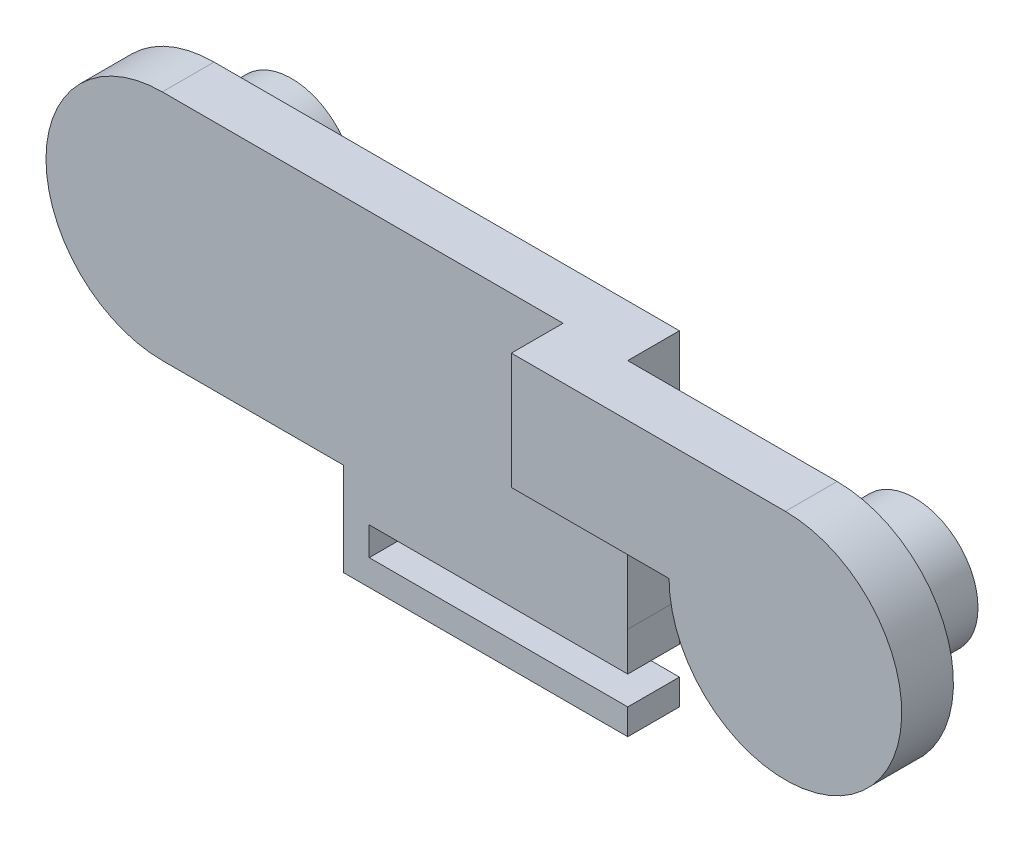
ISO-10303-21;
HEADER;
FILE_DESCRIPTION(('STEP AP214'),'2;1');
FILE_NAME('part.step','',(''),(''),'','','');
FILE_SCHEMA(('AUTOMOTIVE_DESIGN { 1 0 10303 214 1 1 1 1 }'));
ENDSEC;
DATA;
#1=APPLICATION_CONTEXT('core data for automotive mechanical design processes');
#2=APPLICATION_PROTOCOL_DEFINITION('international standard','automotive_design',2000,#1);
#3=PRODUCT_CONTEXT('',#1,'mechanical');
#4=PRODUCT('Part','Part','',(#3));
#5=PRODUCT_RELATED_PRODUCT_CATEGORY('part','',(#4));
#6=PRODUCT_DEFINITION_FORMATION('','',#4);
#7=PRODUCT_DEFINITION_CONTEXT('part definition',#1,'design');
#8=PRODUCT_DEFINITION('design','',#6,#7);
#9=PRODUCT_DEFINITION_SHAPE('','',#8);
#10=(LENGTH_UNIT() NAMED_UNIT(*) SI_UNIT(.MILLI.,.METRE.));
#11=(NAMED_UNIT(*) PLANE_ANGLE_UNIT() SI_UNIT($,.RADIAN.));
#12=(NAMED_UNIT(*) SI_UNIT($,.STERADIAN.) SOLID_ANGLE_UNIT());
#13=UNCERTAINTY_MEASURE_WITH_UNIT(LENGTH_MEASURE(1.E-05),#10,'distance_accuracy_value','');
#14=(GEOMETRIC_REPRESENTATION_CONTEXT(3) GLOBAL_UNCERTAINTY_ASSIGNED_CONTEXT((#13)) GLOBAL_UNIT_ASSIGNED_CONTEXT((#10,
#11,#12)) REPRESENTATION_CONTEXT('',''));
#15=CARTESIAN_POINT('',(0.,0.,0.));
#16=DIRECTION('',(0.,0.,1.));
#17=DIRECTION('',(1.,0.,0.));
#18=AXIS2_PLACEMENT_3D('',#15,#16,#17);
#19=CARTESIAN_POINT('',(0.,0.,-2.));
#20=DIRECTION('',(0.,0.,1.));
#21=DIRECTION('',(1.,0.,0.));
#22=AXIS2_PLACEMENT_3D('',#19,#20,#21);
#23=PLANE('',#22);
#24=DIRECTION('',(0.,-1.,0.));
#25=VECTOR('',#24,1.);
#26=CARTESIAN_POINT('',(-69.4585846447346,-15.9103392702647,-2.));
#27=LINE('',#26,#25);
#28=CARTESIAN_POINT('',(-69.4585846447346,-14.9103392702646,-2.));
#29=VERTEX_POINT('',#28);
#30=CARTESIAN_POINT('',(-69.4585846447346,-15.9103392702647,-2.));
#31=VERTEX_POINT('',#30);
#32=EDGE_CURVE('E11',#29,#31,#27,.T.);
#33=ORIENTED_EDGE('',*,*,#32,.F.);
#34=DIRECTION('',(1.,0.,0.));
#35=VECTOR('',#34,1.);
#36=CARTESIAN_POINT('',(-70.4585846447346,-14.9103392702646,-2.));
#37=LINE('',#36,#35);
#38=CARTESIAN_POINT('',(-60.4585846447346,-14.9103392702646,-2.));
#39=VERTEX_POINT('',#38);
#40=EDGE_CURVE('E197',#29,#39,#37,.T.);
#41=ORIENTED_EDGE('',*,*,#40,.T.);
#42=DIRECTION('',(0.,-1.,0.));
#43=VECTOR('',#42,1.);
#44=CARTESIAN_POINT('',(-60.4585846447346,-15.9103392702647,-2.));
#45=LINE('',#44,#43);
#46=CARTESIAN_POINT('',(-60.4585846447346,-15.9103392702647,-2.));
#47=VERTEX_POINT('',#46);
#48=EDGE_CURVE('E220',#39,#47,#45,.T.);
#49=ORIENTED_EDGE('',*,*,#48,.T.);
#50=DIRECTION('',(-1.,0.,0.));
#51=VECTOR('',#50,1.);
#52=CARTESIAN_POINT('',(-70.4585846447346,-15.9103392702647,-2.));
#53=LINE('',#52,#51);
#54=EDGE_CURVE('E54',#47,#31,#53,.T.);
#55=ORIENTED_EDGE('',*,*,#54,.T.);
#56=EDGE_LOOP('',(#33,#41,#49,#55));
#57=FACE_BOUND('',#56,.T.);
#58=ADVANCED_FACE('F36',(#57),#23,.F.);
#59=CARTESIAN_POINT('',(-78.460741065967,-7.81033927026465,-2.));
#60=DIRECTION('',(0.,0.,1.));
#61=DIRECTION('',(1.,0.,0.));
#62=AXIS2_PLACEMENT_3D('',#59,#60,#61);
#63=CIRCLE('',#62,2.44999999993865);
#64=CARTESIAN_POINT('',(-76.0107410660284,-7.81033927026465,-2.));
#65=VERTEX_POINT('',#64);
#66=EDGE_CURVE('E664',#65,#65,#63,.T.);
#67=ORIENTED_EDGE('',*,*,#66,.T.);
#68=EDGE_LOOP('',(#67));
#69=FACE_BOUND('',#68,.T.);
#70=CARTESIAN_POINT('',(-69.4585846447346,-12.9103392702647,-2.));
#71=VERTEX_POINT('',#70);
#72=CARTESIAN_POINT('',(-69.4585846447346,-13.8103392702646,-2.));
#73=VERTEX_POINT('',#72);
#74=EDGE_CURVE('E46',#71,#73,#27,.T.);
#75=ORIENTED_EDGE('',*,*,#74,.F.);
#76=DIRECTION('',(1.,0.,0.));
#77=VECTOR('',#76,1.);
#78=CARTESIAN_POINT('',(-71.4585846447346,-12.9103392702647,-2.));
#79=LINE('',#78,#77);
#80=CARTESIAN_POINT('',(-71.4585846447346,-12.9103392702647,-2.));
#81=VERTEX_POINT('',#80);
#82=EDGE_CURVE('E667',#81,#71,#79,.T.);
#83=ORIENTED_EDGE('',*,*,#82,.F.);
#84=DIRECTION('',(0.,1.,0.));
#85=VECTOR('',#84,1.);
#86=CARTESIAN_POINT('',(-71.4585846447346,-12.3103392702647,-2.));
#87=LINE('',#86,#85);
#88=CARTESIAN_POINT('',(-71.4585846447346,-12.3103392702647,-2.));
#89=VERTEX_POINT('',#88);
#90=EDGE_CURVE('E193',#81,#89,#87,.T.);
#91=ORIENTED_EDGE('',*,*,#90,.T.);
#92=DIRECTION('',(-1.,0.,0.));
#93=VECTOR('',#92,1.);
#94=CARTESIAN_POINT('',(0.,-12.3103392702647,-2.));
#95=LINE('',#94,#93);
#96=CARTESIAN_POINT('',(-78.460741065967,-12.3103392702647,-2.));
#97=VERTEX_POINT('',#96);
#98=EDGE_CURVE('E249',#89,#97,#95,.T.);
#99=ORIENTED_EDGE('',*,*,#98,.T.);
#100=CARTESIAN_POINT('',(-78.460741065967,-7.81033927026465,-2.));
#101=DIRECTION('',(0.,0.,1.));
#102=DIRECTION('',(1.,0.,0.));
#103=AXIS2_PLACEMENT_3D('',#100,#101,#102);
#104=CIRCLE('',#103,4.5);
#105=CARTESIAN_POINT('',(-78.460741065967,-3.31033927026466,-2.));
#106=VERTEX_POINT('',#105);
#107=EDGE_CURVE('E245',#106,#97,#104,.T.);
#108=ORIENTED_EDGE('',*,*,#107,.F.);
#109=DIRECTION('',(-1.,0.,0.));
#110=VECTOR('',#109,1.);
#111=CARTESIAN_POINT('',(0.,-3.31033927026466,-2.));
#112=LINE('',#111,#110);
#113=CARTESIAN_POINT('',(-60.460741065967,-3.31033927026466,-2.));
#114=VERTEX_POINT('',#113);
#115=EDGE_CURVE('E242',#114,#106,#112,.T.);
#116=ORIENTED_EDGE('',*,*,#115,.F.);
#117=DIRECTION('',(0.,-1.,0.));
#118=VECTOR('',#117,1.);
#119=CARTESIAN_POINT('',(-60.460741065967,0.,-2.));
#120=LINE('',#119,#118);
#121=CARTESIAN_POINT('',(-60.460741065967,-12.3103392702646,-2.));
#122=VERTEX_POINT('',#121);
#123=EDGE_CURVE('E258',#114,#122,#120,.T.);
#124=ORIENTED_EDGE('',*,*,#123,.T.);
#125=DIRECTION('',(-0.00143761266932871,0.999998966634373,0.));
#126=VECTOR('',#125,1.);
#127=CARTESIAN_POINT('',(-60.478313591339,-0.0869444796839806,-2.));
#128=LINE('',#127,#126);
#129=CARTESIAN_POINT('',(-60.4585846447346,-13.8103392702646,-2.));
#130=VERTEX_POINT('',#129);
#131=EDGE_CURVE('E255',#130,#122,#128,.T.);
#132=ORIENTED_EDGE('',*,*,#131,.F.);
#133=DIRECTION('',(-1.,0.,0.));
#134=VECTOR('',#133,1.);
#135=CARTESIAN_POINT('',(0.,-13.8103392702646,-2.));
#136=LINE('',#135,#134);
#137=EDGE_CURVE('E252',#130,#73,#136,.T.);
#138=ORIENTED_EDGE('',*,*,#137,.T.);
#139=EDGE_LOOP('',(#75,#83,#91,#99,#108,#116,#124,#132,#138));
#140=FACE_BOUND('',#139,.T.);
#141=ADVANCED_FACE('F348',(#69,#140),#23,.F.);
#142=CARTESIAN_POINT('',(0.,0.,0.));
#143=DIRECTION('',(0.,0.,1.));
#144=DIRECTION('',(1.,0.,0.));
#145=AXIS2_PLACEMENT_3D('',#142,#143,#144);
#146=PLANE('',#145);
#147=CARTESIAN_POINT('',(-52.360741065967,-7.81033927026465,0.));
#148=DIRECTION('',(0.,0.,1.));
#149=DIRECTION('',(1.,0.,0.));
#150=AXIS2_PLACEMENT_3D('',#147,#148,#149);
#151=CIRCLE('',#150,2.45000000005522);
#152=CARTESIAN_POINT('',(-49.9107410659118,-7.81033927026465,0.));
#153=VERTEX_POINT('',#152);
#154=EDGE_CURVE('E238',#153,#153,#151,.T.);
#155=ORIENTED_EDGE('',*,*,#154,.T.);
#156=EDGE_LOOP('',(#155));
#157=FACE_BOUND('',#156,.T.);
#158=DIRECTION('',(0.,-1.,0.));
#159=VECTOR('',#158,1.);
#160=CARTESIAN_POINT('',(-60.460741065967,0.,0.));
#161=LINE('',#160,#159);
#162=CARTESIAN_POINT('',(-60.460741065967,-3.31033927026466,0.));
#163=VERTEX_POINT('',#162);
#164=CARTESIAN_POINT('',(-60.460741065967,-7.81033927026466,0.));
#165=VERTEX_POINT('',#164);
#166=EDGE_CURVE('E246',#163,#165,#161,.T.);
#167=ORIENTED_EDGE('',*,*,#166,.F.);
#168=DIRECTION('',(-1.,0.,0.));
#169=VECTOR('',#168,1.);
#170=CARTESIAN_POINT('',(0.,-3.31033927026466,0.));
#171=LINE('',#170,#169);
#172=CARTESIAN_POINT('',(-52.360741065967,-3.31033927026466,0.));
#173=VERTEX_POINT('',#172);
#174=EDGE_CURVE('E305',#173,#163,#171,.T.);
#175=ORIENTED_EDGE('',*,*,#174,.F.);
#176=CARTESIAN_POINT('',(-52.360741065967,-7.81033927026465,0.));
#177=DIRECTION('',(0.,0.,1.));
#178=DIRECTION('',(1.,0.,0.));
#179=AXIS2_PLACEMENT_3D('',#176,#177,#178);
#180=CIRCLE('',#179,4.5);
#181=CARTESIAN_POINT('',(-56.860741065967,-7.81033927026466,0.));
#182=VERTEX_POINT('',#181);
#183=EDGE_CURVE('E313',#182,#173,#180,.T.);
#184=ORIENTED_EDGE('',*,*,#183,.F.);
#185=DIRECTION('',(-1.,0.,0.));
#186=VECTOR('',#185,1.);
#187=CARTESIAN_POINT('',(0.,-7.81033927026466,0.));
#188=LINE('',#187,#186);
#189=EDGE_CURVE('E311',#182,#165,#188,.T.);
#190=ORIENTED_EDGE('',*,*,#189,.T.);
#191=EDGE_LOOP('',(#167,#175,#184,#190));
#192=FACE_BOUND('',#191,.T.);
#193=ADVANCED_FACE('F328',(#157,#192),#146,.F.);
#194=CARTESIAN_POINT('',(0.,-7.81033927026466,2.));
#195=DIRECTION('',(0.,-1.,0.));
#196=DIRECTION('',(0.,0.,-1.));
#197=AXIS2_PLACEMENT_3D('',#194,#195,#196);
#198=PLANE('',#197);
#199=ORIENTED_EDGE('',*,*,#189,.F.);
#200=DIRECTION('',(0.,0.,-1.));
#201=VECTOR('',#200,1.);
#202=CARTESIAN_POINT('',(-56.860741065967,-7.81033927026466,2.));
#203=LINE('',#202,#201);
#204=CARTESIAN_POINT('',(-56.860741065967,-7.81033927026466,2.));
#205=VERTEX_POINT('',#204);
#206=EDGE_CURVE('E40',#205,#182,#203,.T.);
#207=ORIENTED_EDGE('',*,*,#206,.F.);
#208=DIRECTION('',(-1.,0.,0.));
#209=VECTOR('',#208,1.);
#210=CARTESIAN_POINT('',(0.,-7.81033927026466,2.));
#211=LINE('',#210,#209);
#212=CARTESIAN_POINT('',(-62.960741065967,-7.81033927026466,2.));
#213=VERTEX_POINT('',#212);
#214=EDGE_CURVE('E302',#205,#213,#211,.T.);
#215=ORIENTED_EDGE('',*,*,#214,.T.);
#216=DIRECTION('',(0.,0.,-1.));
#217=VECTOR('',#216,1.);
#218=CARTESIAN_POINT('',(-62.960741065967,-7.81033927026466,2.));
#219=LINE('',#218,#217);
#220=CARTESIAN_POINT('',(-62.960741065967,-7.81033927026466,0.));
#221=VERTEX_POINT('',#220);
#222=EDGE_CURVE('E295',#213,#221,#219,.T.);
#223=ORIENTED_EDGE('',*,*,#222,.T.);
#224=EDGE_CURVE('E301',#165,#221,#188,.T.);
#225=ORIENTED_EDGE('',*,*,#224,.F.);
#226=EDGE_LOOP('',(#199,#207,#215,#223,#225));
#227=FACE_BOUND('',#226,.T.);
#228=ADVANCED_FACE('F38',(#227),#198,.T.);
#229=CARTESIAN_POINT('',(-52.360741065967,-7.81033927026465,2.));
#230=DIRECTION('',(0.,0.,-1.));
#231=DIRECTION('',(-1.,0.,0.));
#232=AXIS2_PLACEMENT_3D('',#229,#230,#231);
#233=CYLINDRICAL_SURFACE('',#232,4.5);
#234=ORIENTED_EDGE('',*,*,#183,.T.);
#235=DIRECTION('',(0.,0.,-1.));
#236=VECTOR('',#235,1.);
#237=CARTESIAN_POINT('',(-52.360741065967,-3.31033927026466,2.));
#238=LINE('',#237,#236);
#239=CARTESIAN_POINT('',(-52.360741065967,-3.31033927026466,2.));
#240=VERTEX_POINT('',#239);
#241=EDGE_CURVE('E310',#240,#173,#238,.T.);
#242=ORIENTED_EDGE('',*,*,#241,.F.);
#243=CARTESIAN_POINT('',(-52.360741065967,-7.81033927026465,2.));
#244=DIRECTION('',(0.,0.,1.));
#245=DIRECTION('',(1.,0.,0.));
#246=AXIS2_PLACEMENT_3D('',#243,#244,#245);
#247=CIRCLE('',#246,4.5);
#248=EDGE_CURVE('E304',#205,#240,#247,.T.);
#249=ORIENTED_EDGE('',*,*,#248,.F.);
#250=ORIENTED_EDGE('',*,*,#206,.T.);
#251=EDGE_LOOP('',(#234,#242,#249,#250));
#252=FACE_BOUND('',#251,.T.);
#253=ADVANCED_FACE('F323',(#252),#233,.T.);
#254=CARTESIAN_POINT('',(0.,-3.31033927026466,2.));
#255=DIRECTION('',(0.,-1.,0.));
#256=DIRECTION('',(1.,0.,0.));
#257=AXIS2_PLACEMENT_3D('',#254,#255,#256);
#258=PLANE('',#257);
#259=ORIENTED_EDGE('',*,*,#174,.T.);
#260=DIRECTION('',(0.,0.,1.));
#261=VECTOR('',#260,1.);
#262=CARTESIAN_POINT('',(-60.460741065967,-3.31033927026466,-2.));
#263=LINE('',#262,#261);
#264=EDGE_CURVE('E275',#114,#163,#263,.T.);
#265=ORIENTED_EDGE('',*,*,#264,.F.);
#266=ORIENTED_EDGE('',*,*,#115,.T.);
#267=DIRECTION('',(0.,0.,1.));
#268=VECTOR('',#267,1.);
#269=CARTESIAN_POINT('',(-78.460741065967,-3.31033927026466,-2.));
#270=LINE('',#269,#268);
#271=CARTESIAN_POINT('',(-78.460741065967,-3.31033927026466,0.));
#272=VERTEX_POINT('',#271);
#273=EDGE_CURVE('E260',#106,#272,#270,.T.);
#274=ORIENTED_EDGE('',*,*,#273,.T.);
#275=DIRECTION('',(-1.,0.,0.));
#276=VECTOR('',#275,1.);
#277=CARTESIAN_POINT('',(0.,-3.31033927026466,0.));
#278=LINE('',#277,#276);
#279=CARTESIAN_POINT('',(-62.960741065967,-3.31033927026466,0.));
#280=VERTEX_POINT('',#279);
#281=EDGE_CURVE('E241',#280,#272,#278,.T.);
#282=ORIENTED_EDGE('',*,*,#281,.F.);
#283=DIRECTION('',(0.,0.,-1.));
#284=VECTOR('',#283,1.);
#285=CARTESIAN_POINT('',(-62.960741065967,-3.31033927026466,2.));
#286=LINE('',#285,#284);
#287=CARTESIAN_POINT('',(-62.960741065967,-3.31033927026466,2.));
#288=VERTEX_POINT('',#287);
#289=EDGE_CURVE('E299',#288,#280,#286,.T.);
#290=ORIENTED_EDGE('',*,*,#289,.F.);
#291=DIRECTION('',(-1.,0.,0.));
#292=VECTOR('',#291,1.);
#293=CARTESIAN_POINT('',(0.,-3.31033927026466,2.));
#294=LINE('',#293,#292);
#295=EDGE_CURVE('E308',#240,#288,#294,.T.);
#296=ORIENTED_EDGE('',*,*,#295,.F.);
#297=ORIENTED_EDGE('',*,*,#241,.T.);
#298=EDGE_LOOP('',(#259,#265,#266,#274,#282,#290,#296,#297));
#299=FACE_BOUND('',#298,.T.);
#300=ADVANCED_FACE('F343',(#299),#258,.F.);
#301=CARTESIAN_POINT('',(0.,0.,2.));
#302=DIRECTION('',(0.,0.,1.));
#303=DIRECTION('',(1.,0.,0.));
#304=AXIS2_PLACEMENT_3D('',#301,#302,#303);
#305=PLANE('',#304);
#306=ORIENTED_EDGE('',*,*,#214,.F.);
#307=ORIENTED_EDGE('',*,*,#248,.T.);
#308=ORIENTED_EDGE('',*,*,#295,.T.);
#309=DIRECTION('',(0.,-1.,0.));
#310=VECTOR('',#309,1.);
#311=CARTESIAN_POINT('',(-62.960741065967,-3.31033927026466,2.));
#312=LINE('',#311,#310);
#313=EDGE_CURVE('E292',#288,#213,#312,.T.);
#314=ORIENTED_EDGE('',*,*,#313,.T.);
#315=EDGE_LOOP('',(#306,#307,#308,#314));
#316=FACE_BOUND('',#315,.T.);
#317=ADVANCED_FACE('F360',(#316),#305,.T.);
#318=CARTESIAN_POINT('',(-62.960741065967,-3.31033927026466,2.));
#319=DIRECTION('',(1.,0.,0.));
#320=DIRECTION('',(0.,0.,-1.));
#321=AXIS2_PLACEMENT_3D('',#318,#319,#320);
#322=PLANE('',#321);
#323=DIRECTION('',(0.,-1.,0.));
#324=VECTOR('',#323,1.);
#325=CARTESIAN_POINT('',(-62.960741065967,-3.31033927026466,0.));
#326=LINE('',#325,#324);
#327=EDGE_CURVE('E278',#280,#221,#326,.T.);
#328=ORIENTED_EDGE('',*,*,#327,.T.);
#329=ORIENTED_EDGE('',*,*,#222,.F.);
#330=ORIENTED_EDGE('',*,*,#313,.F.);
#331=ORIENTED_EDGE('',*,*,#289,.T.);
#332=EDGE_LOOP('',(#328,#329,#330,#331));
#333=FACE_BOUND('',#332,.T.);
#334=ADVANCED_FACE('F358',(#333),#322,.F.);
#335=CARTESIAN_POINT('',(-60.460741065967,0.,-2.));
#336=DIRECTION('',(-1.,0.,0.));
#337=DIRECTION('',(0.,0.,1.));
#338=AXIS2_PLACEMENT_3D('',#335,#336,#337);
#339=PLANE('',#338);
#340=ORIENTED_EDGE('',*,*,#166,.T.);
#341=CARTESIAN_POINT('',(-60.460741065967,-12.3103392702646,0.));
#342=VERTEX_POINT('',#341);
#343=EDGE_CURVE('E272',#165,#342,#161,.T.);
#344=ORIENTED_EDGE('',*,*,#343,.T.);
#345=DIRECTION('',(0.,0.,1.));
#346=VECTOR('',#345,1.);
#347=CARTESIAN_POINT('',(-60.460741065967,-12.3103392702646,-2.));
#348=LINE('',#347,#346);
#349=EDGE_CURVE('E279',#122,#342,#348,.T.);
#350=ORIENTED_EDGE('',*,*,#349,.F.);
#351=ORIENTED_EDGE('',*,*,#123,.F.);
#352=ORIENTED_EDGE('',*,*,#264,.T.);
#353=EDGE_LOOP('',(#340,#344,#350,#351,#352));
#354=FACE_BOUND('',#353,.T.);
#355=ADVANCED_FACE('F341',(#354),#339,.F.);
#356=CARTESIAN_POINT('',(-60.478313591339,-0.0869444796839806,-2.));
#357=DIRECTION('',(0.999998966634373,0.00143761266932871,0.));
#358=DIRECTION('',(-0.00143761266932871,0.999998966634373,0.));
#359=AXIS2_PLACEMENT_3D('',#356,#357,#358);
#360=PLANE('',#359);
#361=DIRECTION('',(-0.00143761266932871,0.999998966634373,0.));
#362=VECTOR('',#361,1.);
#363=CARTESIAN_POINT('',(-60.478313591339,-0.0869444796839806,0.));
#364=LINE('',#363,#362);
#365=CARTESIAN_POINT('',(-60.4585846447346,-13.8103392702646,0.));
#366=VERTEX_POINT('',#365);
#367=EDGE_CURVE('E269',#366,#342,#364,.T.);
#368=ORIENTED_EDGE('',*,*,#367,.F.);
#369=DIRECTION('',(0.,0.,1.));
#370=VECTOR('',#369,1.);
#371=CARTESIAN_POINT('',(-60.4585846447346,-13.8103392702646,-2.));
#372=LINE('',#371,#370);
#373=EDGE_CURVE('E282',#130,#366,#372,.T.);
#374=ORIENTED_EDGE('',*,*,#373,.F.);
#375=ORIENTED_EDGE('',*,*,#131,.T.);
#376=ORIENTED_EDGE('',*,*,#349,.T.);
#377=EDGE_LOOP('',(#368,#374,#375,#376));
#378=FACE_BOUND('',#377,.T.);
#379=ADVANCED_FACE('F384',(#378),#360,.T.);
#380=CARTESIAN_POINT('',(0.,-13.8103392702646,-2.));
#381=DIRECTION('',(0.,1.,0.));
#382=DIRECTION('',(0.,0.,1.));
#383=AXIS2_PLACEMENT_3D('',#380,#381,#382);
#384=PLANE('',#383);
#385=DIRECTION('',(-1.,0.,0.));
#386=VECTOR('',#385,1.);
#387=CARTESIAN_POINT('',(0.,-13.8103392702646,0.));
#388=LINE('',#387,#386);
#389=CARTESIAN_POINT('',(-70.4585846447346,-13.8103392702646,0.));
#390=VERTEX_POINT('',#389);
#391=EDGE_CURVE('E267',#366,#390,#388,.T.);
#392=ORIENTED_EDGE('',*,*,#391,.T.);
#393=DIRECTION('',(0.,0.,1.));
#394=VECTOR('',#393,1.);
#395=CARTESIAN_POINT('',(-70.4585846447346,-13.8103392702646,-2.));
#396=LINE('',#395,#394);
#397=CARTESIAN_POINT('',(-70.4585846447346,-13.8103392702646,-2.));
#398=VERTEX_POINT('',#397);
#399=EDGE_CURVE('E284',#398,#390,#396,.T.);
#400=ORIENTED_EDGE('',*,*,#399,.F.);
#401=EDGE_CURVE('E251',#73,#398,#136,.T.);
#402=ORIENTED_EDGE('',*,*,#401,.F.);
#403=ORIENTED_EDGE('',*,*,#137,.F.);
#404=ORIENTED_EDGE('',*,*,#373,.T.);
#405=EDGE_LOOP('',(#392,#400,#402,#403,#404));
#406=FACE_BOUND('',#405,.T.);
#407=ADVANCED_FACE('F387',(#406),#384,.F.);
#408=CARTESIAN_POINT('',(0.,-12.3103392702647,-2.));
#409=DIRECTION('',(0.,1.,0.));
#410=DIRECTION('',(0.,0.,1.));
#411=AXIS2_PLACEMENT_3D('',#408,#409,#410);
#412=PLANE('',#411);
#413=ORIENTED_EDGE('',*,*,#98,.F.);
#414=DIRECTION('',(0.,0.,-1.));
#415=VECTOR('',#414,1.);
#416=CARTESIAN_POINT('',(-71.4585846447346,-12.3103392702647,0.));
#417=LINE('',#416,#415);
#418=CARTESIAN_POINT('',(-71.4585846447346,-12.3103392702647,0.));
#419=VERTEX_POINT('',#418);
#420=EDGE_CURVE('E224',#419,#89,#417,.T.);
#421=ORIENTED_EDGE('',*,*,#420,.F.);
#422=DIRECTION('',(-1.,0.,0.));
#423=VECTOR('',#422,1.);
#424=CARTESIAN_POINT('',(0.,-12.3103392702647,0.));
#425=LINE('',#424,#423);
#426=CARTESIAN_POINT('',(-78.460741065967,-12.3103392702647,0.));
#427=VERTEX_POINT('',#426);
#428=EDGE_CURVE('E265',#419,#427,#425,.T.);
#429=ORIENTED_EDGE('',*,*,#428,.T.);
#430=DIRECTION('',(0.,0.,1.));
#431=VECTOR('',#430,1.);
#432=CARTESIAN_POINT('',(-78.460741065967,-12.3103392702647,-2.));
#433=LINE('',#432,#431);
#434=EDGE_CURVE('E287',#97,#427,#433,.T.);
#435=ORIENTED_EDGE('',*,*,#434,.F.);
#436=EDGE_LOOP('',(#413,#421,#429,#435));
#437=FACE_BOUND('',#436,.T.);
#438=ADVANCED_FACE('F391',(#437),#412,.F.);
#439=CARTESIAN_POINT('',(-78.460741065967,-7.81033927026465,-2.));
#440=DIRECTION('',(0.,0.,1.));
#441=DIRECTION('',(1.,0.,0.));
#442=AXIS2_PLACEMENT_3D('',#439,#440,#441);
#443=CYLINDRICAL_SURFACE('',#442,4.5);
#444=CARTESIAN_POINT('',(-78.460741065967,-7.81033927026465,0.));
#445=DIRECTION('',(0.,0.,1.));
#446=DIRECTION('',(1.,0.,0.));
#447=AXIS2_PLACEMENT_3D('',#444,#445,#446);
#448=CIRCLE('',#447,4.5);
#449=EDGE_CURVE('E262',#272,#427,#448,.T.);
#450=ORIENTED_EDGE('',*,*,#449,.F.);
#451=ORIENTED_EDGE('',*,*,#273,.F.);
#452=ORIENTED_EDGE('',*,*,#107,.T.);
#453=ORIENTED_EDGE('',*,*,#434,.T.);
#454=EDGE_LOOP('',(#450,#451,#452,#453));
#455=FACE_BOUND('',#454,.T.);
#456=ADVANCED_FACE('F353',(#455),#443,.T.);
#457=CARTESIAN_POINT('',(0.,0.,0.));
#458=DIRECTION('',(0.,0.,1.));
#459=DIRECTION('',(1.,0.,0.));
#460=AXIS2_PLACEMENT_3D('',#457,#458,#459);
#461=PLANE('',#460);
#462=ORIENTED_EDGE('',*,*,#428,.F.);
#463=DIRECTION('',(0.,1.,0.));
#464=VECTOR('',#463,1.);
#465=CARTESIAN_POINT('',(-71.4585846447346,-13.8103392702646,0.));
#466=LINE('',#465,#464);
#467=CARTESIAN_POINT('',(-71.4585846447346,-15.9103392702647,0.));
#468=VERTEX_POINT('',#467);
#469=EDGE_CURVE('E213',#468,#419,#466,.T.);
#470=ORIENTED_EDGE('',*,*,#469,.F.);
#471=DIRECTION('',(-1.,0.,0.));
#472=VECTOR('',#471,1.);
#473=CARTESIAN_POINT('',(-70.4585846447346,-15.9103392702647,0.));
#474=LINE('',#473,#472);
#475=CARTESIAN_POINT('',(-60.4585846447346,-15.9103392702647,0.));
#476=VERTEX_POINT('',#475);
#477=EDGE_CURVE('E211',#476,#468,#474,.T.);
#478=ORIENTED_EDGE('',*,*,#477,.F.);
#479=DIRECTION('',(0.,-1.,0.));
#480=VECTOR('',#479,1.);
#481=CARTESIAN_POINT('',(-60.4585846447346,-15.9103392702647,0.));
#482=LINE('',#481,#480);
#483=CARTESIAN_POINT('',(-60.4585846447346,-14.9103392702646,0.));
#484=VERTEX_POINT('',#483);
#485=EDGE_CURVE('E208',#484,#476,#482,.T.);
#486=ORIENTED_EDGE('',*,*,#485,.F.);
#487=DIRECTION('',(1.,0.,0.));
#488=VECTOR('',#487,1.);
#489=CARTESIAN_POINT('',(-70.4585846447346,-14.9103392702646,0.));
#490=LINE('',#489,#488);
#491=CARTESIAN_POINT('',(-70.4585846447346,-14.9103392702646,0.));
#492=VERTEX_POINT('',#491);
#493=EDGE_CURVE('E205',#492,#484,#490,.T.);
#494=ORIENTED_EDGE('',*,*,#493,.F.);
#495=DIRECTION('',(0.,-1.,0.));
#496=VECTOR('',#495,1.);
#497=CARTESIAN_POINT('',(-70.4585846447346,-12.3103392702647,0.));
#498=LINE('',#497,#496);
#499=EDGE_CURVE('E203',#390,#492,#498,.T.);
#500=ORIENTED_EDGE('',*,*,#499,.F.);
#501=ORIENTED_EDGE('',*,*,#391,.F.);
#502=ORIENTED_EDGE('',*,*,#367,.T.);
#503=ORIENTED_EDGE('',*,*,#343,.F.);
#504=ORIENTED_EDGE('',*,*,#224,.T.);
#505=ORIENTED_EDGE('',*,*,#327,.F.);
#506=ORIENTED_EDGE('',*,*,#281,.T.);
#507=ORIENTED_EDGE('',*,*,#449,.T.);
#508=EDGE_LOOP('',(#462,#470,#478,#486,#494,#500,#501,#502,#503,#504,#505,#506,#507));
#509=FACE_BOUND('',#508,.T.);
#510=ADVANCED_FACE('F336',(#509),#461,.T.);
#511=CARTESIAN_POINT('',(-52.360741065967,-7.81033927026465,-3.));
#512=DIRECTION('',(0.,0.,1.));
#513=DIRECTION('',(1.,0.,0.));
#514=AXIS2_PLACEMENT_3D('',#511,#512,#513);
#515=CYLINDRICAL_SURFACE('',#514,2.45000000005522);
#516=CARTESIAN_POINT('',(-52.360741065967,-7.81033927026465,-3.));
#517=DIRECTION('',(0.,0.,1.));
#518=DIRECTION('',(1.,0.,0.));
#519=AXIS2_PLACEMENT_3D('',#516,#517,#518);
#520=CIRCLE('',#519,2.45000000005522);
#521=CARTESIAN_POINT('',(-49.9107410659118,-7.81033927026465,-3.));
#522=VERTEX_POINT('',#521);
#523=EDGE_CURVE('E226',#522,#522,#520,.T.);
#524=ORIENTED_EDGE('',*,*,#523,.T.);
#525=EDGE_LOOP('',(#524));
#526=FACE_BOUND('',#525,.T.);
#527=ORIENTED_EDGE('',*,*,#154,.F.);
#528=EDGE_LOOP('',(#527));
#529=FACE_BOUND('',#528,.T.);
#530=ADVANCED_FACE('F378',(#526,#529),#515,.T.);
#531=CARTESIAN_POINT('',(-52.360741065967,-7.81033927026465,-3.));
#532=DIRECTION('',(0.,0.,1.));
#533=DIRECTION('',(1.,0.,0.));
#534=AXIS2_PLACEMENT_3D('',#531,#532,#533);
#535=PLANE('',#534);
#536=ORIENTED_EDGE('',*,*,#523,.F.);
#537=EDGE_LOOP('',(#536));
#538=FACE_BOUND('',#537,.T.);
#539=ADVANCED_FACE('F414',(#538),#535,.F.);
#540=CARTESIAN_POINT('',(-70.4585846447346,-13.8103392702646,0.));
#541=DIRECTION('',(1.,0.,0.));
#542=DIRECTION('',(0.,0.,-1.));
#543=AXIS2_PLACEMENT_3D('',#540,#541,#542);
#544=PLANE('',#543);
#545=ORIENTED_EDGE('',*,*,#399,.T.);
#546=ORIENTED_EDGE('',*,*,#499,.T.);
#547=DIRECTION('',(0.,0.,-1.));
#548=VECTOR('',#547,1.);
#549=CARTESIAN_POINT('',(-70.4585846447346,-14.9103392702646,0.));
#550=LINE('',#549,#548);
#551=CARTESIAN_POINT('',(-70.4585846447346,-14.9103392702646,-2.));
#552=VERTEX_POINT('',#551);
#553=EDGE_CURVE('E215',#492,#552,#550,.T.);
#554=ORIENTED_EDGE('',*,*,#553,.T.);
#555=DIRECTION('',(0.,-1.,0.));
#556=VECTOR('',#555,1.);
#557=CARTESIAN_POINT('',(-70.4585846447346,-13.8103392702646,-2.));
#558=LINE('',#557,#556);
#559=EDGE_CURVE('E194',#398,#552,#558,.T.);
#560=ORIENTED_EDGE('',*,*,#559,.F.);
#561=EDGE_LOOP('',(#545,#546,#554,#560));
#562=FACE_BOUND('',#561,.T.);
#563=ADVANCED_FACE('F421',(#562),#544,.T.);
#564=CARTESIAN_POINT('',(-71.4585846447346,-12.3103392702647,0.));
#565=DIRECTION('',(-1.,0.,0.));
#566=DIRECTION('',(0.,0.,1.));
#567=AXIS2_PLACEMENT_3D('',#564,#565,#566);
#568=PLANE('',#567);
#569=ORIENTED_EDGE('',*,*,#90,.F.);
#570=DIRECTION('',(0.,0.,1.));
#571=VECTOR('',#570,1.);
#572=CARTESIAN_POINT('',(-71.4585846447346,-12.9103392702647,-3.));
#573=LINE('',#572,#571);
#574=CARTESIAN_POINT('',(-71.4585846447346,-12.9103392702647,-3.));
#575=VERTEX_POINT('',#574);
#576=EDGE_CURVE('E174',#575,#81,#573,.T.);
#577=ORIENTED_EDGE('',*,*,#576,.F.);
#578=DIRECTION('',(0.,1.,0.));
#579=VECTOR('',#578,1.);
#580=CARTESIAN_POINT('',(-71.4585846447346,-15.9103392702647,-3.));
#581=LINE('',#580,#579);
#582=CARTESIAN_POINT('',(-71.4585846447346,-15.9103392702647,-3.));
#583=VERTEX_POINT('',#582);
#584=EDGE_CURVE('E180',#583,#575,#581,.T.);
#585=ORIENTED_EDGE('',*,*,#584,.F.);
#586=DIRECTION('',(0.,0.,-1.));
#587=VECTOR('',#586,1.);
#588=CARTESIAN_POINT('',(-71.4585846447346,-15.9103392702647,0.));
#589=LINE('',#588,#587);
#590=EDGE_CURVE('E227',#468,#583,#589,.T.);
#591=ORIENTED_EDGE('',*,*,#590,.F.);
#592=ORIENTED_EDGE('',*,*,#469,.T.);
#593=ORIENTED_EDGE('',*,*,#420,.T.);
#594=EDGE_LOOP('',(#569,#577,#585,#591,#592,#593));
#595=FACE_BOUND('',#594,.T.);
#596=ADVANCED_FACE('F191',(#595),#568,.T.);
#597=CARTESIAN_POINT('',(-70.4585846447346,-15.9103392702647,0.));
#598=DIRECTION('',(0.,-1.,0.));
#599=DIRECTION('',(0.,0.,-1.));
#600=AXIS2_PLACEMENT_3D('',#597,#598,#599);
#601=PLANE('',#600);
#602=ORIENTED_EDGE('',*,*,#54,.F.);
#603=DIRECTION('',(0.,0.,-1.));
#604=VECTOR('',#603,1.);
#605=CARTESIAN_POINT('',(-60.4585846447346,-15.9103392702647,0.));
#606=LINE('',#605,#604);
#607=EDGE_CURVE('E229',#476,#47,#606,.T.);
#608=ORIENTED_EDGE('',*,*,#607,.F.);
#609=ORIENTED_EDGE('',*,*,#477,.T.);
#610=ORIENTED_EDGE('',*,*,#590,.T.);
#611=DIRECTION('',(-1.,0.,0.));
#612=VECTOR('',#611,1.);
#613=CARTESIAN_POINT('',(-71.4585846447346,-15.9103392702647,-3.));
#614=LINE('',#613,#612);
#615=CARTESIAN_POINT('',(-69.4585846447346,-15.9103392702647,-3.));
#616=VERTEX_POINT('',#615);
#617=EDGE_CURVE('E186',#616,#583,#614,.T.);
#618=ORIENTED_EDGE('',*,*,#617,.F.);
#619=DIRECTION('',(0.,0.,1.));
#620=VECTOR('',#619,1.);
#621=CARTESIAN_POINT('',(-69.4585846447346,-15.9103392702647,-3.));
#622=LINE('',#621,#620);
#623=EDGE_CURVE('E199',#616,#31,#622,.T.);
#624=ORIENTED_EDGE('',*,*,#623,.T.);
#625=EDGE_LOOP('',(#602,#608,#609,#610,#618,#624));
#626=FACE_BOUND('',#625,.T.);
#627=ADVANCED_FACE('F436',(#626),#601,.T.);
#628=CARTESIAN_POINT('',(-60.4585846447346,-15.9103392702647,0.));
#629=DIRECTION('',(1.,0.,0.));
#630=DIRECTION('',(0.,0.,-1.));
#631=AXIS2_PLACEMENT_3D('',#628,#629,#630);
#632=PLANE('',#631);
#633=ORIENTED_EDGE('',*,*,#48,.F.);
#634=DIRECTION('',(0.,0.,-1.));
#635=VECTOR('',#634,1.);
#636=CARTESIAN_POINT('',(-60.4585846447346,-14.9103392702646,0.));
#637=LINE('',#636,#635);
#638=EDGE_CURVE('E232',#484,#39,#637,.T.);
#639=ORIENTED_EDGE('',*,*,#638,.F.);
#640=ORIENTED_EDGE('',*,*,#485,.T.);
#641=ORIENTED_EDGE('',*,*,#607,.T.);
#642=EDGE_LOOP('',(#633,#639,#640,#641));
#643=FACE_BOUND('',#642,.T.);
#644=ADVANCED_FACE('F443',(#643),#632,.T.);
#645=CARTESIAN_POINT('',(-70.4585846447346,-14.9103392702646,0.));
#646=DIRECTION('',(0.,1.,0.));
#647=DIRECTION('',(-1.,0.,0.));
#648=AXIS2_PLACEMENT_3D('',#645,#646,#647);
#649=PLANE('',#648);
#650=EDGE_CURVE('E217',#552,#29,#37,.T.);
#651=ORIENTED_EDGE('',*,*,#650,.F.);
#652=ORIENTED_EDGE('',*,*,#553,.F.);
#653=ORIENTED_EDGE('',*,*,#493,.T.);
#654=ORIENTED_EDGE('',*,*,#638,.T.);
#655=ORIENTED_EDGE('',*,*,#40,.F.);
#656=EDGE_LOOP('',(#651,#652,#653,#654,#655));
#657=FACE_BOUND('',#656,.T.);
#658=ADVANCED_FACE('F452',(#657),#649,.T.);
#659=CARTESIAN_POINT('',(0.,0.,-2.));
#660=DIRECTION('',(0.,0.,-1.));
#661=DIRECTION('',(-1.,0.,0.));
#662=AXIS2_PLACEMENT_3D('',#659,#660,#661);
#663=PLANE('',#662);
#664=EDGE_CURVE('E47',#73,#29,#27,.T.);
#665=ORIENTED_EDGE('',*,*,#664,.F.);
#666=ORIENTED_EDGE('',*,*,#401,.T.);
#667=ORIENTED_EDGE('',*,*,#559,.T.);
#668=ORIENTED_EDGE('',*,*,#650,.T.);
#669=EDGE_LOOP('',(#665,#666,#667,#668));
#670=FACE_BOUND('',#669,.T.);
#671=ADVANCED_FACE('F459',(#670),#663,.F.);
#672=CARTESIAN_POINT('',(-71.4585846447346,-12.9103392702647,-3.));
#673=DIRECTION('',(0.,-1.,0.));
#674=DIRECTION('',(0.,0.,-1.));
#675=AXIS2_PLACEMENT_3D('',#672,#673,#674);
#676=PLANE('',#675);
#677=ORIENTED_EDGE('',*,*,#82,.T.);
#678=DIRECTION('',(0.,0.,1.));
#679=VECTOR('',#678,1.);
#680=CARTESIAN_POINT('',(-69.4585846447346,-12.9103392702647,-3.));
#681=LINE('',#680,#679);
#682=CARTESIAN_POINT('',(-69.4585846447346,-12.9103392702647,-3.));
#683=VERTEX_POINT('',#682);
#684=EDGE_CURVE('E176',#683,#71,#681,.T.);
#685=ORIENTED_EDGE('',*,*,#684,.F.);
#686=DIRECTION('',(1.,0.,0.));
#687=VECTOR('',#686,1.);
#688=CARTESIAN_POINT('',(-71.4585846447346,-12.9103392702647,-3.));
#689=LINE('',#688,#687);
#690=EDGE_CURVE('E169',#575,#683,#689,.T.);
#691=ORIENTED_EDGE('',*,*,#690,.F.);
#692=ORIENTED_EDGE('',*,*,#576,.T.);
#693=EDGE_LOOP('',(#677,#685,#691,#692));
#694=FACE_BOUND('',#693,.T.);
#695=ADVANCED_FACE('F172',(#694),#676,.F.);
#696=CARTESIAN_POINT('',(-69.4585846447346,-15.9103392702647,-3.));
#697=DIRECTION('',(-1.,0.,0.));
#698=DIRECTION('',(0.,0.,1.));
#699=AXIS2_PLACEMENT_3D('',#696,#697,#698);
#700=PLANE('',#699);
#701=ORIENTED_EDGE('',*,*,#74,.T.);
#702=ORIENTED_EDGE('',*,*,#664,.T.);
#703=ORIENTED_EDGE('',*,*,#32,.T.);
#704=ORIENTED_EDGE('',*,*,#623,.F.);
#705=DIRECTION('',(0.,-1.,0.));
#706=VECTOR('',#705,1.);
#707=CARTESIAN_POINT('',(-69.4585846447346,-15.9103392702647,-3.));
#708=LINE('',#707,#706);
#709=EDGE_CURVE('E179',#683,#616,#708,.T.);
#710=ORIENTED_EDGE('',*,*,#709,.F.);
#711=ORIENTED_EDGE('',*,*,#684,.T.);
#712=EDGE_LOOP('',(#701,#702,#703,#704,#710,#711));
#713=FACE_BOUND('',#712,.T.);
#714=ADVANCED_FACE('F474',(#713),#700,.F.);
#715=CARTESIAN_POINT('',(0.,0.,-3.));
#716=DIRECTION('',(0.,0.,-1.));
#717=DIRECTION('',(-1.,0.,0.));
#718=AXIS2_PLACEMENT_3D('',#715,#716,#717);
#719=PLANE('',#718);
#720=ORIENTED_EDGE('',*,*,#584,.T.);
#721=ORIENTED_EDGE('',*,*,#690,.T.);
#722=ORIENTED_EDGE('',*,*,#709,.T.);
#723=ORIENTED_EDGE('',*,*,#617,.T.);
#724=EDGE_LOOP('',(#720,#721,#722,#723));
#725=FACE_BOUND('',#724,.T.);
#726=ADVANCED_FACE('F184',(#725),#719,.T.);
#727=CARTESIAN_POINT('',(-78.460741065967,-7.81033927026465,-5.));
#728=DIRECTION('',(0.,0.,1.));
#729=DIRECTION('',(1.,0.,0.));
#730=AXIS2_PLACEMENT_3D('',#727,#728,#729);
#731=CYLINDRICAL_SURFACE('',#730,2.44999999993865);
#732=CARTESIAN_POINT('',(-78.460741065967,-7.81033927026465,-5.));
#733=DIRECTION('',(0.,0.,1.));
#734=DIRECTION('',(1.,0.,0.));
#735=AXIS2_PLACEMENT_3D('',#732,#733,#734);
#736=CIRCLE('',#735,2.44999999993865);
#737=CARTESIAN_POINT('',(-76.0107410660284,-7.81033927026465,-5.));
#738=VERTEX_POINT('',#737);
#739=EDGE_CURVE('E663',#738,#738,#736,.T.);
#740=ORIENTED_EDGE('',*,*,#739,.T.);
#741=EDGE_LOOP('',(#740));
#742=FACE_BOUND('',#741,.T.);
#743=ORIENTED_EDGE('',*,*,#66,.F.);
#744=EDGE_LOOP('',(#743));
#745=FACE_BOUND('',#744,.T.);
#746=ADVANCED_FACE('F487',(#742,#745),#731,.T.);
#747=CARTESIAN_POINT('',(-78.460741065967,-7.81033927026465,-5.));
#748=DIRECTION('',(0.,0.,1.));
#749=DIRECTION('',(1.,0.,0.));
#750=AXIS2_PLACEMENT_3D('',#747,#748,#749);
#751=PLANE('',#750);
#752=ORIENTED_EDGE('',*,*,#739,.F.);
#753=EDGE_LOOP('',(#752));
#754=FACE_BOUND('',#753,.T.);
#755=ADVANCED_FACE('F493',(#754),#751,.F.);
#756=CLOSED_SHELL('',(#58,#141,#193,#228,#253,#300,#317,#334,#355,#379,#407,#438,#456,#510,#530,
#539,#563,#596,#627,#644,#658,#671,#695,#714,#726,#746,#755));
#757=MANIFOLD_SOLID_BREP('B2',#756);
#758=ADVANCED_BREP_SHAPE_REPRESENTATION('',(#18,#757),#14);
#759=SHAPE_DEFINITION_REPRESENTATION(#9,#758);
ENDSEC;
END-ISO-10303-21;
